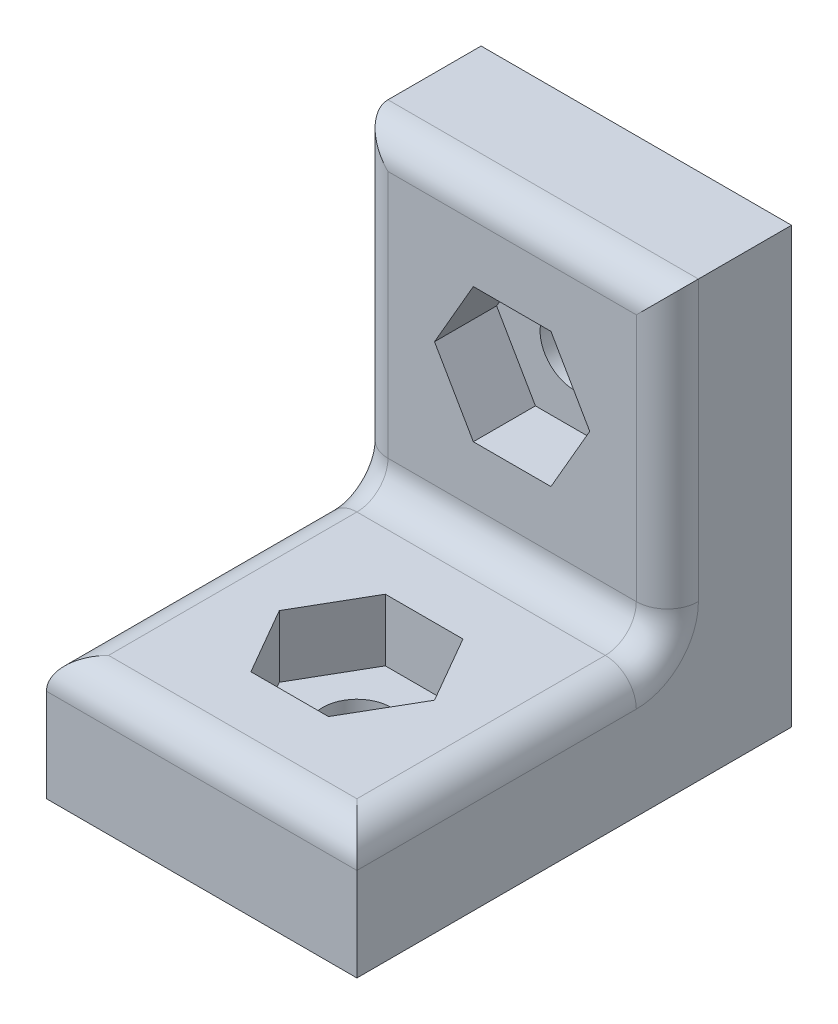
ISO-10303-21;
HEADER;
FILE_DESCRIPTION(('STEP AP214'),'2;1');
FILE_NAME('part.step','',(''),(''),'','','');
FILE_SCHEMA(('AUTOMOTIVE_DESIGN { 1 0 10303 214 1 1 1 1 }'));
ENDSEC;
DATA;
#1=APPLICATION_CONTEXT('core data for automotive mechanical design processes');
#2=APPLICATION_PROTOCOL_DEFINITION('international standard','automotive_design',2000,#1);
#3=PRODUCT_CONTEXT('',#1,'mechanical');
#4=PRODUCT('Part','Part','',(#3));
#5=PRODUCT_RELATED_PRODUCT_CATEGORY('part','',(#4));
#6=PRODUCT_DEFINITION_FORMATION('','',#4);
#7=PRODUCT_DEFINITION_CONTEXT('part definition',#1,'design');
#8=PRODUCT_DEFINITION('design','',#6,#7);
#9=PRODUCT_DEFINITION_SHAPE('','',#8);
#10=(LENGTH_UNIT() NAMED_UNIT(*) SI_UNIT(.MILLI.,.METRE.));
#11=(NAMED_UNIT(*) PLANE_ANGLE_UNIT() SI_UNIT($,.RADIAN.));
#12=(NAMED_UNIT(*) SI_UNIT($,.STERADIAN.) SOLID_ANGLE_UNIT());
#13=UNCERTAINTY_MEASURE_WITH_UNIT(LENGTH_MEASURE(1.E-05),#10,'distance_accuracy_value','');
#14=(GEOMETRIC_REPRESENTATION_CONTEXT(3) GLOBAL_UNCERTAINTY_ASSIGNED_CONTEXT((#13)) GLOBAL_UNIT_ASSIGNED_CONTEXT((#10,
#11,#12)) REPRESENTATION_CONTEXT('',''));
#15=CARTESIAN_POINT('',(0.,0.,0.));
#16=DIRECTION('',(0.,0.,1.));
#17=DIRECTION('',(1.,0.,0.));
#18=AXIS2_PLACEMENT_3D('',#15,#16,#17);
#19=CARTESIAN_POINT('',(0.,0.,9.));
#20=DIRECTION('',(0.,1.,0.));
#21=DIRECTION('',(0.,0.,1.));
#22=AXIS2_PLACEMENT_3D('',#19,#20,#21);
#23=CYLINDRICAL_SURFACE('',#22,1.1);
#24=CARTESIAN_POINT('',(0.,0.,9.));
#25=DIRECTION('',(0.,1.,0.));
#26=DIRECTION('',(0.,0.,1.));
#27=AXIS2_PLACEMENT_3D('',#24,#25,#26);
#28=CIRCLE('',#27,1.1);
#29=CARTESIAN_POINT('',(0.,0.,10.1));
#30=VERTEX_POINT('',#29);
#31=EDGE_CURVE('E299',#30,#30,#28,.T.);
#32=ORIENTED_EDGE('',*,*,#31,.F.);
#33=EDGE_LOOP('',(#32));
#34=FACE_BOUND('',#33,.T.);
#35=CARTESIAN_POINT('',(0.,2.,9.));
#36=DIRECTION('',(0.,1.,0.));
#37=DIRECTION('',(0.,0.,1.));
#38=AXIS2_PLACEMENT_3D('',#35,#36,#37);
#39=CIRCLE('',#38,1.1);
#40=CARTESIAN_POINT('',(0.,2.,10.1));
#41=VERTEX_POINT('',#40);
#42=EDGE_CURVE('E44',#41,#41,#39,.F.);
#43=ORIENTED_EDGE('',*,*,#42,.F.);
#44=EDGE_LOOP('',(#43));
#45=FACE_BOUND('',#44,.T.);
#46=ADVANCED_FACE('F40',(#34,#45),#23,.F.);
#47=CARTESIAN_POINT('',(0.,9.,0.));
#48=DIRECTION('',(0.,0.,1.));
#49=DIRECTION('',(1.,0.,0.));
#50=AXIS2_PLACEMENT_3D('',#47,#48,#49);
#51=CYLINDRICAL_SURFACE('',#50,1.1);
#52=CARTESIAN_POINT('',(0.,9.,0.));
#53=DIRECTION('',(0.,0.,1.));
#54=DIRECTION('',(1.,0.,0.));
#55=AXIS2_PLACEMENT_3D('',#52,#53,#54);
#56=CIRCLE('',#55,1.1);
#57=CARTESIAN_POINT('',(1.1,9.,0.));
#58=VERTEX_POINT('',#57);
#59=EDGE_CURVE('E303',#58,#58,#56,.T.);
#60=ORIENTED_EDGE('',*,*,#59,.F.);
#61=EDGE_LOOP('',(#60));
#62=FACE_BOUND('',#61,.T.);
#63=CARTESIAN_POINT('',(0.,9.,2.));
#64=DIRECTION('',(0.,0.,1.));
#65=DIRECTION('',(1.,0.,0.));
#66=AXIS2_PLACEMENT_3D('',#63,#64,#65);
#67=CIRCLE('',#66,1.1);
#68=CARTESIAN_POINT('',(1.1,9.,2.));
#69=VERTEX_POINT('',#68);
#70=EDGE_CURVE('E289',#69,#69,#67,.F.);
#71=ORIENTED_EDGE('',*,*,#70,.F.);
#72=EDGE_LOOP('',(#71));
#73=FACE_BOUND('',#72,.T.);
#74=ADVANCED_FACE('F399',(#62,#73),#51,.F.);
#75=CARTESIAN_POINT('',(-5.,14.,4.));
#76=DIRECTION('',(1.,0.,0.));
#77=DIRECTION('',(0.,1.,0.));
#78=AXIS2_PLACEMENT_3D('',#75,#76,#77);
#79=PLANE('',#78);
#80=CARTESIAN_POINT('',(-5.,5.,5.));
#81=DIRECTION('',(1.,0.,0.));
#82=DIRECTION('',(0.,1.,0.));
#83=AXIS2_PLACEMENT_3D('',#80,#81,#82);
#84=CIRCLE('',#83,2.);
#85=CARTESIAN_POINT('',(-5.,5.,3.));
#86=VERTEX_POINT('',#85);
#87=CARTESIAN_POINT('',(-5.,3.,5.));
#88=VERTEX_POINT('',#87);
#89=EDGE_CURVE('E353',#86,#88,#84,.F.);
#90=ORIENTED_EDGE('',*,*,#89,.F.);
#91=DIRECTION('',(0.,-1.,0.));
#92=VECTOR('',#91,1.);
#93=CARTESIAN_POINT('',(-5.,14.,3.));
#94=LINE('',#93,#92);
#95=CARTESIAN_POINT('',(-5.,14.,3.));
#96=VERTEX_POINT('',#95);
#97=EDGE_CURVE('E358',#86,#96,#94,.F.);
#98=ORIENTED_EDGE('',*,*,#97,.T.);
#99=DIRECTION('',(0.,0.,-1.));
#100=VECTOR('',#99,1.);
#101=CARTESIAN_POINT('',(-5.,14.,4.));
#102=LINE('',#101,#100);
#103=CARTESIAN_POINT('',(-5.,14.,0.));
#104=VERTEX_POINT('',#103);
#105=EDGE_CURVE('E326',#96,#104,#102,.T.);
#106=ORIENTED_EDGE('',*,*,#105,.T.);
#107=DIRECTION('',(0.,-1.,0.));
#108=VECTOR('',#107,1.);
#109=CARTESIAN_POINT('',(-5.,14.,0.));
#110=LINE('',#109,#108);
#111=CARTESIAN_POINT('',(-5.,0.,0.));
#112=VERTEX_POINT('',#111);
#113=EDGE_CURVE('E315',#104,#112,#110,.T.);
#114=ORIENTED_EDGE('',*,*,#113,.T.);
#115=DIRECTION('',(0.,0.,-1.));
#116=VECTOR('',#115,1.);
#117=CARTESIAN_POINT('',(-5.,0.,4.));
#118=LINE('',#117,#116);
#119=CARTESIAN_POINT('',(-5.,0.,14.));
#120=VERTEX_POINT('',#119);
#121=EDGE_CURVE('E333',#120,#112,#118,.T.);
#122=ORIENTED_EDGE('',*,*,#121,.F.);
#123=DIRECTION('',(0.,-1.,0.));
#124=VECTOR('',#123,1.);
#125=CARTESIAN_POINT('',(-5.,0.,14.));
#126=LINE('',#125,#124);
#127=CARTESIAN_POINT('',(-5.,3.,14.));
#128=VERTEX_POINT('',#127);
#129=EDGE_CURVE('E306',#128,#120,#126,.T.);
#130=ORIENTED_EDGE('',*,*,#129,.F.);
#131=DIRECTION('',(0.,0.,-1.));
#132=VECTOR('',#131,1.);
#133=CARTESIAN_POINT('',(-5.,3.,4.));
#134=LINE('',#133,#132);
#135=EDGE_CURVE('E356',#128,#88,#134,.T.);
#136=ORIENTED_EDGE('',*,*,#135,.T.);
#137=EDGE_LOOP('',(#90,#98,#106,#114,#122,#130,#136));
#138=FACE_BOUND('',#137,.T.);
#139=ADVANCED_FACE('F401',(#138),#79,.F.);
#140=CARTESIAN_POINT('',(-5.,0.,4.));
#141=DIRECTION('',(0.,1.,0.));
#142=DIRECTION('',(0.,0.,1.));
#143=AXIS2_PLACEMENT_3D('',#140,#141,#142);
#144=PLANE('',#143);
#145=ORIENTED_EDGE('',*,*,#31,.T.);
#146=EDGE_LOOP('',(#145));
#147=FACE_BOUND('',#146,.T.);
#148=DIRECTION('',(1.,0.,0.));
#149=VECTOR('',#148,1.);
#150=CARTESIAN_POINT('',(-5.,0.,0.));
#151=LINE('',#150,#149);
#152=CARTESIAN_POINT('',(5.,0.,0.));
#153=VERTEX_POINT('',#152);
#154=EDGE_CURVE('E318',#112,#153,#151,.T.);
#155=ORIENTED_EDGE('',*,*,#154,.T.);
#156=DIRECTION('',(0.,0.,-1.));
#157=VECTOR('',#156,1.);
#158=CARTESIAN_POINT('',(5.,0.,4.));
#159=LINE('',#158,#157);
#160=CARTESIAN_POINT('',(5.,0.,14.));
#161=VERTEX_POINT('',#160);
#162=EDGE_CURVE('E330',#161,#153,#159,.T.);
#163=ORIENTED_EDGE('',*,*,#162,.F.);
#164=DIRECTION('',(1.,0.,0.));
#165=VECTOR('',#164,1.);
#166=CARTESIAN_POINT('',(-5.,0.,14.));
#167=LINE('',#166,#165);
#168=EDGE_CURVE('E309',#120,#161,#167,.T.);
#169=ORIENTED_EDGE('',*,*,#168,.F.);
#170=ORIENTED_EDGE('',*,*,#121,.T.);
#171=EDGE_LOOP('',(#155,#163,#169,#170));
#172=FACE_BOUND('',#171,.T.);
#173=ADVANCED_FACE('F408',(#147,#172),#144,.F.);
#174=CARTESIAN_POINT('',(5.,14.,4.));
#175=DIRECTION('',(-1.,0.,0.));
#176=DIRECTION('',(0.,-1.,0.));
#177=AXIS2_PLACEMENT_3D('',#174,#175,#176);
#178=PLANE('',#177);
#179=DIRECTION('',(0.,0.,-1.));
#180=VECTOR('',#179,1.);
#181=CARTESIAN_POINT('',(5.,14.,4.));
#182=LINE('',#181,#180);
#183=CARTESIAN_POINT('',(5.,14.,3.));
#184=VERTEX_POINT('',#183);
#185=CARTESIAN_POINT('',(5.,14.,0.));
#186=VERTEX_POINT('',#185);
#187=EDGE_CURVE('E328',#184,#186,#182,.T.);
#188=ORIENTED_EDGE('',*,*,#187,.F.);
#189=DIRECTION('',(0.,1.,0.));
#190=VECTOR('',#189,1.);
#191=CARTESIAN_POINT('',(5.,4.,3.));
#192=LINE('',#191,#190);
#193=CARTESIAN_POINT('',(5.,5.,3.));
#194=VERTEX_POINT('',#193);
#195=EDGE_CURVE('E350',#184,#194,#192,.F.);
#196=ORIENTED_EDGE('',*,*,#195,.T.);
#197=CARTESIAN_POINT('',(5.,5.,5.));
#198=DIRECTION('',(-1.,0.,0.));
#199=DIRECTION('',(0.,-1.,0.));
#200=AXIS2_PLACEMENT_3D('',#197,#198,#199);
#201=CIRCLE('',#200,2.);
#202=CARTESIAN_POINT('',(5.,3.,5.));
#203=VERTEX_POINT('',#202);
#204=EDGE_CURVE('E347',#203,#194,#201,.F.);
#205=ORIENTED_EDGE('',*,*,#204,.F.);
#206=DIRECTION('',(0.,0.,-1.));
#207=VECTOR('',#206,1.);
#208=CARTESIAN_POINT('',(5.,3.,4.));
#209=LINE('',#208,#207);
#210=CARTESIAN_POINT('',(5.,3.,14.));
#211=VERTEX_POINT('',#210);
#212=EDGE_CURVE('E345',#203,#211,#209,.F.);
#213=ORIENTED_EDGE('',*,*,#212,.T.);
#214=DIRECTION('',(0.,1.,0.));
#215=VECTOR('',#214,1.);
#216=CARTESIAN_POINT('',(5.,0.,14.));
#217=LINE('',#216,#215);
#218=EDGE_CURVE('E312',#161,#211,#217,.T.);
#219=ORIENTED_EDGE('',*,*,#218,.F.);
#220=ORIENTED_EDGE('',*,*,#162,.T.);
#221=DIRECTION('',(0.,1.,0.));
#222=VECTOR('',#221,1.);
#223=CARTESIAN_POINT('',(5.,14.,0.));
#224=LINE('',#223,#222);
#225=EDGE_CURVE('E320',#153,#186,#224,.T.);
#226=ORIENTED_EDGE('',*,*,#225,.T.);
#227=EDGE_LOOP('',(#188,#196,#205,#213,#219,#220,#226));
#228=FACE_BOUND('',#227,.T.);
#229=ADVANCED_FACE('F435',(#228),#178,.F.);
#230=CARTESIAN_POINT('',(-5.,14.,4.));
#231=DIRECTION('',(0.,-1.,0.));
#232=DIRECTION('',(0.,0.,-1.));
#233=AXIS2_PLACEMENT_3D('',#230,#231,#232);
#234=PLANE('',#233);
#235=ORIENTED_EDGE('',*,*,#105,.F.);
#236=DIRECTION('',(-1.,0.,0.));
#237=VECTOR('',#236,1.);
#238=CARTESIAN_POINT('',(5.,14.,3.));
#239=LINE('',#238,#237);
#240=EDGE_CURVE('E360',#96,#184,#239,.F.);
#241=ORIENTED_EDGE('',*,*,#240,.T.);
#242=ORIENTED_EDGE('',*,*,#187,.T.);
#243=DIRECTION('',(-1.,0.,0.));
#244=VECTOR('',#243,1.);
#245=CARTESIAN_POINT('',(-5.,14.,0.));
#246=LINE('',#245,#244);
#247=EDGE_CURVE('E323',#186,#104,#246,.T.);
#248=ORIENTED_EDGE('',*,*,#247,.T.);
#249=EDGE_LOOP('',(#235,#241,#242,#248));
#250=FACE_BOUND('',#249,.T.);
#251=ADVANCED_FACE('F428',(#250),#234,.F.);
#252=CARTESIAN_POINT('',(0.,0.,4.));
#253=DIRECTION('',(0.,0.,1.));
#254=DIRECTION('',(1.,0.,0.));
#255=AXIS2_PLACEMENT_3D('',#252,#253,#254);
#256=PLANE('',#255);
#257=DIRECTION('',(1.,0.,0.));
#258=VECTOR('',#257,1.);
#259=CARTESIAN_POINT('',(-1.25,6.83493649053891,4.));
#260=LINE('',#259,#258);
#261=CARTESIAN_POINT('',(-1.25,6.83493649053891,4.));
#262=VERTEX_POINT('',#261);
#263=CARTESIAN_POINT('',(1.25,6.83493649053891,4.));
#264=VERTEX_POINT('',#263);
#265=EDGE_CURVE('E65',#262,#264,#260,.T.);
#266=ORIENTED_EDGE('',*,*,#265,.F.);
#267=DIRECTION('',(0.5,-0.866025403784439,0.));
#268=VECTOR('',#267,1.);
#269=CARTESIAN_POINT('',(-2.5,9.,4.));
#270=LINE('',#269,#268);
#271=CARTESIAN_POINT('',(-2.5,9.,4.));
#272=VERTEX_POINT('',#271);
#273=EDGE_CURVE('E256',#272,#262,#270,.T.);
#274=ORIENTED_EDGE('',*,*,#273,.F.);
#275=DIRECTION('',(-0.5,-0.866025403784438,0.));
#276=VECTOR('',#275,1.);
#277=CARTESIAN_POINT('',(-1.25,11.1650635094611,4.));
#278=LINE('',#277,#276);
#279=CARTESIAN_POINT('',(-1.25,11.1650635094611,4.));
#280=VERTEX_POINT('',#279);
#281=EDGE_CURVE('E282',#280,#272,#278,.T.);
#282=ORIENTED_EDGE('',*,*,#281,.F.);
#283=DIRECTION('',(-1.,0.,0.));
#284=VECTOR('',#283,1.);
#285=CARTESIAN_POINT('',(1.25,11.1650635094611,4.));
#286=LINE('',#285,#284);
#287=CARTESIAN_POINT('',(1.25,11.1650635094611,4.));
#288=VERTEX_POINT('',#287);
#289=EDGE_CURVE('E279',#288,#280,#286,.T.);
#290=ORIENTED_EDGE('',*,*,#289,.F.);
#291=DIRECTION('',(-0.5,0.866025403784439,0.));
#292=VECTOR('',#291,1.);
#293=CARTESIAN_POINT('',(2.5,9.,4.));
#294=LINE('',#293,#292);
#295=CARTESIAN_POINT('',(2.5,9.,4.));
#296=VERTEX_POINT('',#295);
#297=EDGE_CURVE('E276',#296,#288,#294,.T.);
#298=ORIENTED_EDGE('',*,*,#297,.F.);
#299=DIRECTION('',(0.5,0.866025403784439,0.));
#300=VECTOR('',#299,1.);
#301=CARTESIAN_POINT('',(1.25,6.83493649053891,4.));
#302=LINE('',#301,#300);
#303=EDGE_CURVE('E273',#264,#296,#302,.T.);
#304=ORIENTED_EDGE('',*,*,#303,.F.);
#305=EDGE_LOOP('',(#266,#274,#282,#290,#298,#304));
#306=FACE_BOUND('',#305,.T.);
#307=DIRECTION('',(0.,1.,0.));
#308=VECTOR('',#307,1.);
#309=CARTESIAN_POINT('',(4.,14.,4.));
#310=LINE('',#309,#308);
#311=CARTESIAN_POINT('',(4.,5.,4.));
#312=VERTEX_POINT('',#311);
#313=CARTESIAN_POINT('',(4.,13.,4.));
#314=VERTEX_POINT('',#313);
#315=EDGE_CURVE('E340',#312,#314,#310,.T.);
#316=ORIENTED_EDGE('',*,*,#315,.T.);
#317=DIRECTION('',(-1.,0.,0.));
#318=VECTOR('',#317,1.);
#319=CARTESIAN_POINT('',(-5.,13.,4.));
#320=LINE('',#319,#318);
#321=CARTESIAN_POINT('',(-4.,13.,4.));
#322=VERTEX_POINT('',#321);
#323=EDGE_CURVE('E343',#314,#322,#320,.T.);
#324=ORIENTED_EDGE('',*,*,#323,.T.);
#325=DIRECTION('',(0.,-1.,0.));
#326=VECTOR('',#325,1.);
#327=CARTESIAN_POINT('',(-4.,4.,4.));
#328=LINE('',#327,#326);
#329=CARTESIAN_POINT('',(-4.,5.,4.));
#330=VERTEX_POINT('',#329);
#331=EDGE_CURVE('E338',#322,#330,#328,.T.);
#332=ORIENTED_EDGE('',*,*,#331,.T.);
#333=DIRECTION('',(-1.,0.,0.));
#334=VECTOR('',#333,1.);
#335=CARTESIAN_POINT('',(0.,5.,4.));
#336=LINE('',#335,#334);
#337=EDGE_CURVE('E336',#330,#312,#336,.F.);
#338=ORIENTED_EDGE('',*,*,#337,.T.);
#339=EDGE_LOOP('',(#316,#324,#332,#338));
#340=FACE_BOUND('',#339,.T.);
#341=ADVANCED_FACE('F425',(#306,#340),#256,.T.);
#342=CARTESIAN_POINT('',(0.,0.,0.));
#343=DIRECTION('',(0.,0.,1.));
#344=DIRECTION('',(1.,0.,0.));
#345=AXIS2_PLACEMENT_3D('',#342,#343,#344);
#346=PLANE('',#345);
#347=ORIENTED_EDGE('',*,*,#59,.T.);
#348=EDGE_LOOP('',(#347));
#349=FACE_BOUND('',#348,.T.);
#350=ORIENTED_EDGE('',*,*,#113,.F.);
#351=ORIENTED_EDGE('',*,*,#247,.F.);
#352=ORIENTED_EDGE('',*,*,#225,.F.);
#353=ORIENTED_EDGE('',*,*,#154,.F.);
#354=EDGE_LOOP('',(#350,#351,#352,#353));
#355=FACE_BOUND('',#354,.T.);
#356=ADVANCED_FACE('F423',(#349,#355),#346,.F.);
#357=CARTESIAN_POINT('',(-5.,4.,14.));
#358=DIRECTION('',(0.,-1.,0.));
#359=DIRECTION('',(0.,0.,-1.));
#360=AXIS2_PLACEMENT_3D('',#357,#358,#359);
#361=PLANE('',#360);
#362=DIRECTION('',(-0.5,0.,-0.866025403784439));
#363=VECTOR('',#362,1.);
#364=CARTESIAN_POINT('',(2.5,4.,9.));
#365=LINE('',#364,#363);
#366=CARTESIAN_POINT('',(2.5,4.,9.));
#367=VERTEX_POINT('',#366);
#368=CARTESIAN_POINT('',(1.25,4.,6.8349364905389));
#369=VERTEX_POINT('',#368);
#370=EDGE_CURVE('E233',#367,#369,#365,.T.);
#371=ORIENTED_EDGE('',*,*,#370,.F.);
#372=DIRECTION('',(0.5,0.,-0.866025403784439));
#373=VECTOR('',#372,1.);
#374=CARTESIAN_POINT('',(1.25,4.,11.1650635094611));
#375=LINE('',#374,#373);
#376=CARTESIAN_POINT('',(1.25,4.,11.1650635094611));
#377=VERTEX_POINT('',#376);
#378=EDGE_CURVE('E57',#377,#367,#375,.T.);
#379=ORIENTED_EDGE('',*,*,#378,.F.);
#380=DIRECTION('',(1.,0.,0.));
#381=VECTOR('',#380,1.);
#382=CARTESIAN_POINT('',(-1.25,4.,11.1650635094611));
#383=LINE('',#382,#381);
#384=CARTESIAN_POINT('',(-1.25,4.,11.1650635094611));
#385=VERTEX_POINT('',#384);
#386=EDGE_CURVE('E219',#385,#377,#383,.T.);
#387=ORIENTED_EDGE('',*,*,#386,.F.);
#388=DIRECTION('',(0.5,0.,0.866025403784439));
#389=VECTOR('',#388,1.);
#390=CARTESIAN_POINT('',(-2.5,4.,9.));
#391=LINE('',#390,#389);
#392=CARTESIAN_POINT('',(-2.5,4.,9.));
#393=VERTEX_POINT('',#392);
#394=EDGE_CURVE('E222',#393,#385,#391,.T.);
#395=ORIENTED_EDGE('',*,*,#394,.F.);
#396=DIRECTION('',(-0.5,0.,0.866025403784439));
#397=VECTOR('',#396,1.);
#398=CARTESIAN_POINT('',(-1.25,4.,6.8349364905389));
#399=LINE('',#398,#397);
#400=CARTESIAN_POINT('',(-1.25,4.,6.8349364905389));
#401=VERTEX_POINT('',#400);
#402=EDGE_CURVE('E238',#401,#393,#399,.T.);
#403=ORIENTED_EDGE('',*,*,#402,.F.);
#404=DIRECTION('',(-1.,0.,0.));
#405=VECTOR('',#404,1.);
#406=CARTESIAN_POINT('',(1.25,4.,6.8349364905389));
#407=LINE('',#406,#405);
#408=EDGE_CURVE('E235',#369,#401,#407,.T.);
#409=ORIENTED_EDGE('',*,*,#408,.F.);
#410=EDGE_LOOP('',(#371,#379,#387,#395,#403,#409));
#411=FACE_BOUND('',#410,.T.);
#412=DIRECTION('',(0.,0.,-1.));
#413=VECTOR('',#412,1.);
#414=CARTESIAN_POINT('',(-4.,4.,14.));
#415=LINE('',#414,#413);
#416=CARTESIAN_POINT('',(-4.,4.,5.));
#417=VERTEX_POINT('',#416);
#418=CARTESIAN_POINT('',(-4.,4.,13.));
#419=VERTEX_POINT('',#418);
#420=EDGE_CURVE('E366',#417,#419,#415,.F.);
#421=ORIENTED_EDGE('',*,*,#420,.T.);
#422=DIRECTION('',(-1.,0.,0.));
#423=VECTOR('',#422,1.);
#424=CARTESIAN_POINT('',(-5.,4.,13.));
#425=LINE('',#424,#423);
#426=CARTESIAN_POINT('',(4.,4.,13.));
#427=VERTEX_POINT('',#426);
#428=EDGE_CURVE('E12',#419,#427,#425,.F.);
#429=ORIENTED_EDGE('',*,*,#428,.T.);
#430=DIRECTION('',(0.,0.,-1.));
#431=VECTOR('',#430,1.);
#432=CARTESIAN_POINT('',(4.,4.,14.));
#433=LINE('',#432,#431);
#434=CARTESIAN_POINT('',(4.,4.,5.));
#435=VERTEX_POINT('',#434);
#436=EDGE_CURVE('E49',#427,#435,#433,.T.);
#437=ORIENTED_EDGE('',*,*,#436,.T.);
#438=DIRECTION('',(-1.,0.,0.));
#439=VECTOR('',#438,1.);
#440=CARTESIAN_POINT('',(-5.,4.,5.));
#441=LINE('',#440,#439);
#442=EDGE_CURVE('E364',#435,#417,#441,.T.);
#443=ORIENTED_EDGE('',*,*,#442,.T.);
#444=EDGE_LOOP('',(#421,#429,#437,#443));
#445=FACE_BOUND('',#444,.T.);
#446=ADVANCED_FACE('F419',(#411,#445),#361,.F.);
#447=CARTESIAN_POINT('',(0.,0.,14.));
#448=DIRECTION('',(0.,0.,-1.));
#449=DIRECTION('',(-1.,0.,0.));
#450=AXIS2_PLACEMENT_3D('',#447,#448,#449);
#451=PLANE('',#450);
#452=ORIENTED_EDGE('',*,*,#218,.T.);
#453=DIRECTION('',(-1.,0.,0.));
#454=VECTOR('',#453,1.);
#455=CARTESIAN_POINT('',(0.,3.,14.));
#456=LINE('',#455,#454);
#457=EDGE_CURVE('E362',#211,#128,#456,.T.);
#458=ORIENTED_EDGE('',*,*,#457,.T.);
#459=ORIENTED_EDGE('',*,*,#129,.T.);
#460=ORIENTED_EDGE('',*,*,#168,.T.);
#461=EDGE_LOOP('',(#452,#458,#459,#460));
#462=FACE_BOUND('',#461,.T.);
#463=ADVANCED_FACE('F416',(#462),#451,.F.);
#464=CARTESIAN_POINT('',(-4.,3.,4.));
#465=DIRECTION('',(0.,0.,-1.));
#466=DIRECTION('',(-1.,0.,0.));
#467=AXIS2_PLACEMENT_3D('',#464,#465,#466);
#468=CYLINDRICAL_SURFACE('',#467,1.);
#469=CARTESIAN_POINT('',(-4.,3.,5.));
#470=DIRECTION('',(0.,0.,-1.));
#471=DIRECTION('',(-1.,0.,0.));
#472=AXIS2_PLACEMENT_3D('',#469,#470,#471);
#473=CIRCLE('',#472,1.);
#474=EDGE_CURVE('E390',#88,#417,#473,.T.);
#475=ORIENTED_EDGE('',*,*,#474,.F.);
#476=ORIENTED_EDGE('',*,*,#135,.F.);
#477=CARTESIAN_POINT('',(-4.,3.,13.));
#478=DIRECTION('',(-0.707106781186547,0.,-0.707106781186547));
#479=DIRECTION('',(0.707106781186547,0.,-0.707106781186547));
#480=AXIS2_PLACEMENT_3D('',#477,#478,#479);
#481=ELLIPSE('',#480,1.41421356237309,1.);
#482=EDGE_CURVE('E307',#419,#128,#481,.F.);
#483=ORIENTED_EDGE('',*,*,#482,.F.);
#484=ORIENTED_EDGE('',*,*,#420,.F.);
#485=EDGE_LOOP('',(#475,#476,#483,#484));
#486=FACE_BOUND('',#485,.T.);
#487=ADVANCED_FACE('F42',(#486),#468,.T.);
#488=CARTESIAN_POINT('',(0.,3.,13.));
#489=DIRECTION('',(-1.,0.,0.));
#490=DIRECTION('',(0.,0.,1.));
#491=AXIS2_PLACEMENT_3D('',#488,#489,#490);
#492=CYLINDRICAL_SURFACE('',#491,1.);
#493=ORIENTED_EDGE('',*,*,#482,.T.);
#494=ORIENTED_EDGE('',*,*,#457,.F.);
#495=CARTESIAN_POINT('',(4.,3.,13.));
#496=DIRECTION('',(0.707106781186547,0.,-0.707106781186547));
#497=DIRECTION('',(-0.707106781186547,0.,-0.707106781186547));
#498=AXIS2_PLACEMENT_3D('',#495,#496,#497);
#499=ELLIPSE('',#498,1.41421356237309,1.);
#500=EDGE_CURVE('E387',#427,#211,#499,.T.);
#501=ORIENTED_EDGE('',*,*,#500,.F.);
#502=ORIENTED_EDGE('',*,*,#428,.F.);
#503=EDGE_LOOP('',(#493,#494,#501,#502));
#504=FACE_BOUND('',#503,.T.);
#505=ADVANCED_FACE('F469',(#504),#492,.T.);
#506=CARTESIAN_POINT('',(-4.,5.,5.));
#507=DIRECTION('',(1.,0.,0.));
#508=DIRECTION('',(0.,1.,0.));
#509=AXIS2_PLACEMENT_3D('',#506,#507,#508);
#510=TOROIDAL_SURFACE('',#509,2.,1.);
#511=ORIENTED_EDGE('',*,*,#89,.T.);
#512=ORIENTED_EDGE('',*,*,#474,.T.);
#513=CARTESIAN_POINT('',(-4.,5.,5.));
#514=DIRECTION('',(1.,0.,0.));
#515=DIRECTION('',(0.,1.,0.));
#516=AXIS2_PLACEMENT_3D('',#513,#514,#515);
#517=CIRCLE('',#516,1.);
#518=EDGE_CURVE('E384',#330,#417,#517,.F.);
#519=ORIENTED_EDGE('',*,*,#518,.F.);
#520=CARTESIAN_POINT('',(-4.,5.,3.));
#521=DIRECTION('',(0.,-1.,0.));
#522=DIRECTION('',(0.,0.,-1.));
#523=AXIS2_PLACEMENT_3D('',#520,#521,#522);
#524=CIRCLE('',#523,1.);
#525=EDGE_CURVE('E381',#86,#330,#524,.F.);
#526=ORIENTED_EDGE('',*,*,#525,.F.);
#527=EDGE_LOOP('',(#511,#512,#519,#526));
#528=FACE_BOUND('',#527,.T.);
#529=ADVANCED_FACE('F466',(#528),#510,.T.);
#530=CARTESIAN_POINT('',(4.,3.,14.));
#531=DIRECTION('',(0.,0.,-1.));
#532=DIRECTION('',(-1.,0.,0.));
#533=AXIS2_PLACEMENT_3D('',#530,#531,#532);
#534=CYLINDRICAL_SURFACE('',#533,1.);
#535=ORIENTED_EDGE('',*,*,#500,.T.);
#536=ORIENTED_EDGE('',*,*,#212,.F.);
#537=CARTESIAN_POINT('',(4.,3.,5.));
#538=DIRECTION('',(0.,0.,-1.));
#539=DIRECTION('',(-1.,0.,0.));
#540=AXIS2_PLACEMENT_3D('',#537,#538,#539);
#541=CIRCLE('',#540,1.);
#542=EDGE_CURVE('E378',#435,#203,#541,.T.);
#543=ORIENTED_EDGE('',*,*,#542,.F.);
#544=ORIENTED_EDGE('',*,*,#436,.F.);
#545=EDGE_LOOP('',(#535,#536,#543,#544));
#546=FACE_BOUND('',#545,.T.);
#547=ADVANCED_FACE('F462',(#546),#534,.T.);
#548=CARTESIAN_POINT('',(-5.,5.,5.));
#549=DIRECTION('',(-1.,0.,0.));
#550=DIRECTION('',(0.,0.,1.));
#551=AXIS2_PLACEMENT_3D('',#548,#549,#550);
#552=CYLINDRICAL_SURFACE('',#551,1.);
#553=ORIENTED_EDGE('',*,*,#518,.T.);
#554=ORIENTED_EDGE('',*,*,#442,.F.);
#555=CARTESIAN_POINT('',(4.,5.,5.));
#556=DIRECTION('',(-1.,0.,0.));
#557=DIRECTION('',(0.,-1.,0.));
#558=AXIS2_PLACEMENT_3D('',#555,#556,#557);
#559=CIRCLE('',#558,1.);
#560=EDGE_CURVE('E375',#312,#435,#559,.T.);
#561=ORIENTED_EDGE('',*,*,#560,.F.);
#562=ORIENTED_EDGE('',*,*,#337,.F.);
#563=EDGE_LOOP('',(#553,#554,#561,#562));
#564=FACE_BOUND('',#563,.T.);
#565=ADVANCED_FACE('F458',(#564),#552,.F.);
#566=CARTESIAN_POINT('',(-4.,0.,3.));
#567=DIRECTION('',(0.,1.,0.));
#568=DIRECTION('',(-1.,0.,0.));
#569=AXIS2_PLACEMENT_3D('',#566,#567,#568);
#570=CYLINDRICAL_SURFACE('',#569,1.);
#571=ORIENTED_EDGE('',*,*,#525,.T.);
#572=ORIENTED_EDGE('',*,*,#331,.F.);
#573=CARTESIAN_POINT('',(-4.,13.,3.));
#574=DIRECTION('',(0.707106781186547,0.707106781186548,0.));
#575=DIRECTION('',(0.707106781186548,-0.707106781186547,0.));
#576=AXIS2_PLACEMENT_3D('',#573,#574,#575);
#577=ELLIPSE('',#576,1.4142135623731,1.);
#578=EDGE_CURVE('E372',#96,#322,#577,.T.);
#579=ORIENTED_EDGE('',*,*,#578,.F.);
#580=ORIENTED_EDGE('',*,*,#97,.F.);
#581=EDGE_LOOP('',(#571,#572,#579,#580));
#582=FACE_BOUND('',#581,.T.);
#583=ADVANCED_FACE('F454',(#582),#570,.T.);
#584=CARTESIAN_POINT('',(4.,5.,5.));
#585=DIRECTION('',(-1.,0.,0.));
#586=DIRECTION('',(0.,-1.,0.));
#587=AXIS2_PLACEMENT_3D('',#584,#585,#586);
#588=TOROIDAL_SURFACE('',#587,2.,1.);
#589=ORIENTED_EDGE('',*,*,#542,.T.);
#590=ORIENTED_EDGE('',*,*,#204,.T.);
#591=CARTESIAN_POINT('',(4.,5.,3.));
#592=DIRECTION('',(0.,-1.,0.));
#593=DIRECTION('',(0.,0.,-1.));
#594=AXIS2_PLACEMENT_3D('',#591,#592,#593);
#595=CIRCLE('',#594,1.);
#596=EDGE_CURVE('E370',#312,#194,#595,.F.);
#597=ORIENTED_EDGE('',*,*,#596,.F.);
#598=ORIENTED_EDGE('',*,*,#560,.T.);
#599=EDGE_LOOP('',(#589,#590,#597,#598));
#600=FACE_BOUND('',#599,.T.);
#601=ADVANCED_FACE('F450',(#600),#588,.T.);
#602=CARTESIAN_POINT('',(0.,13.,3.));
#603=DIRECTION('',(1.,0.,0.));
#604=DIRECTION('',(0.,0.,-1.));
#605=AXIS2_PLACEMENT_3D('',#602,#603,#604);
#606=CYLINDRICAL_SURFACE('',#605,1.);
#607=ORIENTED_EDGE('',*,*,#578,.T.);
#608=ORIENTED_EDGE('',*,*,#323,.F.);
#609=CARTESIAN_POINT('',(4.,13.,3.));
#610=DIRECTION('',(0.707106781186548,-0.707106781186547,0.));
#611=DIRECTION('',(0.707106781186547,0.707106781186548,0.));
#612=AXIS2_PLACEMENT_3D('',#609,#610,#611);
#613=ELLIPSE('',#612,1.41421356237309,1.);
#614=EDGE_CURVE('E302',#184,#314,#613,.T.);
#615=ORIENTED_EDGE('',*,*,#614,.F.);
#616=ORIENTED_EDGE('',*,*,#240,.F.);
#617=EDGE_LOOP('',(#607,#608,#615,#616));
#618=FACE_BOUND('',#617,.T.);
#619=ADVANCED_FACE('F446',(#618),#606,.T.);
#620=CARTESIAN_POINT('',(4.,0.,3.));
#621=DIRECTION('',(0.,-1.,0.));
#622=DIRECTION('',(1.,0.,0.));
#623=AXIS2_PLACEMENT_3D('',#620,#621,#622);
#624=CYLINDRICAL_SURFACE('',#623,1.);
#625=ORIENTED_EDGE('',*,*,#596,.T.);
#626=ORIENTED_EDGE('',*,*,#195,.F.);
#627=ORIENTED_EDGE('',*,*,#614,.T.);
#628=ORIENTED_EDGE('',*,*,#315,.F.);
#629=EDGE_LOOP('',(#625,#626,#627,#628));
#630=FACE_BOUND('',#629,.T.);
#631=ADVANCED_FACE('F443',(#630),#624,.T.);
#632=CARTESIAN_POINT('',(0.,0.,2.));
#633=DIRECTION('',(0.,0.,1.));
#634=DIRECTION('',(1.,0.,0.));
#635=AXIS2_PLACEMENT_3D('',#632,#633,#634);
#636=PLANE('',#635);
#637=DIRECTION('',(1.,0.,0.));
#638=VECTOR('',#637,1.);
#639=CARTESIAN_POINT('',(-1.25,6.83493649053891,2.));
#640=LINE('',#639,#638);
#641=CARTESIAN_POINT('',(-1.25,6.83493649053891,2.));
#642=VERTEX_POINT('',#641);
#643=CARTESIAN_POINT('',(1.25,6.83493649053891,2.));
#644=VERTEX_POINT('',#643);
#645=EDGE_CURVE('E252',#642,#644,#640,.T.);
#646=ORIENTED_EDGE('',*,*,#645,.T.);
#647=DIRECTION('',(0.5,0.866025403784439,0.));
#648=VECTOR('',#647,1.);
#649=CARTESIAN_POINT('',(1.25,6.83493649053891,2.));
#650=LINE('',#649,#648);
#651=CARTESIAN_POINT('',(2.5,9.,2.));
#652=VERTEX_POINT('',#651);
#653=EDGE_CURVE('E255',#644,#652,#650,.T.);
#654=ORIENTED_EDGE('',*,*,#653,.T.);
#655=DIRECTION('',(-0.5,0.866025403784439,0.));
#656=VECTOR('',#655,1.);
#657=CARTESIAN_POINT('',(2.5,9.,2.));
#658=LINE('',#657,#656);
#659=CARTESIAN_POINT('',(1.25,11.1650635094611,2.));
#660=VERTEX_POINT('',#659);
#661=EDGE_CURVE('E259',#652,#660,#658,.T.);
#662=ORIENTED_EDGE('',*,*,#661,.T.);
#663=DIRECTION('',(-1.,0.,0.));
#664=VECTOR('',#663,1.);
#665=CARTESIAN_POINT('',(1.25,11.1650635094611,2.));
#666=LINE('',#665,#664);
#667=CARTESIAN_POINT('',(-1.25,11.1650635094611,2.));
#668=VERTEX_POINT('',#667);
#669=EDGE_CURVE('E262',#660,#668,#666,.T.);
#670=ORIENTED_EDGE('',*,*,#669,.T.);
#671=DIRECTION('',(-0.5,-0.866025403784438,0.));
#672=VECTOR('',#671,1.);
#673=CARTESIAN_POINT('',(-1.25,11.1650635094611,2.));
#674=LINE('',#673,#672);
#675=CARTESIAN_POINT('',(-2.5,9.,2.));
#676=VERTEX_POINT('',#675);
#677=EDGE_CURVE('E265',#668,#676,#674,.T.);
#678=ORIENTED_EDGE('',*,*,#677,.T.);
#679=DIRECTION('',(0.5,-0.866025403784439,0.));
#680=VECTOR('',#679,1.);
#681=CARTESIAN_POINT('',(-2.5,9.,2.));
#682=LINE('',#681,#680);
#683=EDGE_CURVE('E268',#676,#642,#682,.T.);
#684=ORIENTED_EDGE('',*,*,#683,.T.);
#685=EDGE_LOOP('',(#646,#654,#662,#670,#678,#684));
#686=FACE_BOUND('',#685,.T.);
#687=ORIENTED_EDGE('',*,*,#70,.T.);
#688=EDGE_LOOP('',(#687));
#689=FACE_BOUND('',#688,.T.);
#690=ADVANCED_FACE('F397',(#686,#689),#636,.T.);
#691=CARTESIAN_POINT('',(-1.25,6.83493649053891,2.));
#692=DIRECTION('',(0.,-1.,0.));
#693=DIRECTION('',(0.,0.,-1.));
#694=AXIS2_PLACEMENT_3D('',#691,#692,#693);
#695=PLANE('',#694);
#696=ORIENTED_EDGE('',*,*,#265,.T.);
#697=DIRECTION('',(0.,0.,1.));
#698=VECTOR('',#697,1.);
#699=CARTESIAN_POINT('',(1.25,6.83493649053891,2.));
#700=LINE('',#699,#698);
#701=EDGE_CURVE('E271',#644,#264,#700,.T.);
#702=ORIENTED_EDGE('',*,*,#701,.F.);
#703=ORIENTED_EDGE('',*,*,#645,.F.);
#704=DIRECTION('',(0.,0.,1.));
#705=VECTOR('',#704,1.);
#706=CARTESIAN_POINT('',(-1.25,6.83493649053891,2.));
#707=LINE('',#706,#705);
#708=EDGE_CURVE('E287',#642,#262,#707,.T.);
#709=ORIENTED_EDGE('',*,*,#708,.T.);
#710=EDGE_LOOP('',(#696,#702,#703,#709));
#711=FACE_BOUND('',#710,.T.);
#712=ADVANCED_FACE('F627',(#711),#695,.F.);
#713=CARTESIAN_POINT('',(-2.5,9.,2.));
#714=DIRECTION('',(-0.866025403784439,-0.5,0.));
#715=DIRECTION('',(0.5,-0.866025403784439,0.));
#716=AXIS2_PLACEMENT_3D('',#713,#714,#715);
#717=PLANE('',#716);
#718=ORIENTED_EDGE('',*,*,#273,.T.);
#719=ORIENTED_EDGE('',*,*,#708,.F.);
#720=ORIENTED_EDGE('',*,*,#683,.F.);
#721=DIRECTION('',(0.,0.,1.));
#722=VECTOR('',#721,1.);
#723=CARTESIAN_POINT('',(-2.5,9.,2.));
#724=LINE('',#723,#722);
#725=EDGE_CURVE('E290',#676,#272,#724,.T.);
#726=ORIENTED_EDGE('',*,*,#725,.T.);
#727=EDGE_LOOP('',(#718,#719,#720,#726));
#728=FACE_BOUND('',#727,.T.);
#729=ADVANCED_FACE('F636',(#728),#717,.F.);
#730=CARTESIAN_POINT('',(-1.25,11.1650635094611,2.));
#731=DIRECTION('',(-0.866025403784438,0.5,0.));
#732=DIRECTION('',(-0.5,-0.866025403784438,0.));
#733=AXIS2_PLACEMENT_3D('',#730,#731,#732);
#734=PLANE('',#733);
#735=ORIENTED_EDGE('',*,*,#281,.T.);
#736=ORIENTED_EDGE('',*,*,#725,.F.);
#737=ORIENTED_EDGE('',*,*,#677,.F.);
#738=DIRECTION('',(0.,0.,1.));
#739=VECTOR('',#738,1.);
#740=CARTESIAN_POINT('',(-1.25,11.1650635094611,2.));
#741=LINE('',#740,#739);
#742=EDGE_CURVE('E292',#668,#280,#741,.T.);
#743=ORIENTED_EDGE('',*,*,#742,.T.);
#744=EDGE_LOOP('',(#735,#736,#737,#743));
#745=FACE_BOUND('',#744,.T.);
#746=ADVANCED_FACE('F643',(#745),#734,.F.);
#747=CARTESIAN_POINT('',(1.25,11.1650635094611,2.));
#748=DIRECTION('',(0.,1.,0.));
#749=DIRECTION('',(0.,0.,1.));
#750=AXIS2_PLACEMENT_3D('',#747,#748,#749);
#751=PLANE('',#750);
#752=ORIENTED_EDGE('',*,*,#289,.T.);
#753=ORIENTED_EDGE('',*,*,#742,.F.);
#754=ORIENTED_EDGE('',*,*,#669,.F.);
#755=DIRECTION('',(0.,0.,1.));
#756=VECTOR('',#755,1.);
#757=CARTESIAN_POINT('',(1.25,11.1650635094611,2.));
#758=LINE('',#757,#756);
#759=EDGE_CURVE('E294',#660,#288,#758,.T.);
#760=ORIENTED_EDGE('',*,*,#759,.T.);
#761=EDGE_LOOP('',(#752,#753,#754,#760));
#762=FACE_BOUND('',#761,.T.);
#763=ADVANCED_FACE('F652',(#762),#751,.F.);
#764=CARTESIAN_POINT('',(2.5,9.,2.));
#765=DIRECTION('',(0.866025403784439,0.5,0.));
#766=DIRECTION('',(-0.5,0.866025403784439,0.));
#767=AXIS2_PLACEMENT_3D('',#764,#765,#766);
#768=PLANE('',#767);
#769=ORIENTED_EDGE('',*,*,#297,.T.);
#770=ORIENTED_EDGE('',*,*,#759,.F.);
#771=ORIENTED_EDGE('',*,*,#661,.F.);
#772=DIRECTION('',(0.,0.,1.));
#773=VECTOR('',#772,1.);
#774=CARTESIAN_POINT('',(2.5,9.,2.));
#775=LINE('',#774,#773);
#776=EDGE_CURVE('E296',#652,#296,#775,.T.);
#777=ORIENTED_EDGE('',*,*,#776,.T.);
#778=EDGE_LOOP('',(#769,#770,#771,#777));
#779=FACE_BOUND('',#778,.T.);
#780=ADVANCED_FACE('F661',(#779),#768,.F.);
#781=CARTESIAN_POINT('',(1.25,6.83493649053891,2.));
#782=DIRECTION('',(0.866025403784439,-0.5,0.));
#783=DIRECTION('',(0.5,0.866025403784439,0.));
#784=AXIS2_PLACEMENT_3D('',#781,#782,#783);
#785=PLANE('',#784);
#786=ORIENTED_EDGE('',*,*,#303,.T.);
#787=ORIENTED_EDGE('',*,*,#776,.F.);
#788=ORIENTED_EDGE('',*,*,#653,.F.);
#789=ORIENTED_EDGE('',*,*,#701,.T.);
#790=EDGE_LOOP('',(#786,#787,#788,#789));
#791=FACE_BOUND('',#790,.T.);
#792=ADVANCED_FACE('F670',(#791),#785,.F.);
#793=CARTESIAN_POINT('',(0.,2.,0.));
#794=DIRECTION('',(0.,1.,0.));
#795=DIRECTION('',(0.,0.,1.));
#796=AXIS2_PLACEMENT_3D('',#793,#794,#795);
#797=PLANE('',#796);
#798=DIRECTION('',(0.5,0.,-0.866025403784439));
#799=VECTOR('',#798,1.);
#800=CARTESIAN_POINT('',(1.25,2.,11.1650635094611));
#801=LINE('',#800,#799);
#802=CARTESIAN_POINT('',(1.25,2.,11.1650635094611));
#803=VERTEX_POINT('',#802);
#804=CARTESIAN_POINT('',(2.5,2.,9.));
#805=VERTEX_POINT('',#804);
#806=EDGE_CURVE('E199',#803,#805,#801,.T.);
#807=ORIENTED_EDGE('',*,*,#806,.T.);
#808=DIRECTION('',(-0.5,0.,-0.866025403784439));
#809=VECTOR('',#808,1.);
#810=CARTESIAN_POINT('',(2.5,2.,9.));
#811=LINE('',#810,#809);
#812=CARTESIAN_POINT('',(1.25,2.,6.8349364905389));
#813=VERTEX_POINT('',#812);
#814=EDGE_CURVE('E208',#805,#813,#811,.T.);
#815=ORIENTED_EDGE('',*,*,#814,.T.);
#816=DIRECTION('',(-1.,0.,0.));
#817=VECTOR('',#816,1.);
#818=CARTESIAN_POINT('',(1.25,2.,6.8349364905389));
#819=LINE('',#818,#817);
#820=CARTESIAN_POINT('',(-1.25,2.,6.8349364905389));
#821=VERTEX_POINT('',#820);
#822=EDGE_CURVE('E213',#813,#821,#819,.T.);
#823=ORIENTED_EDGE('',*,*,#822,.T.);
#824=DIRECTION('',(-0.5,0.,0.866025403784439));
#825=VECTOR('',#824,1.);
#826=CARTESIAN_POINT('',(-1.25,2.,6.8349364905389));
#827=LINE('',#826,#825);
#828=CARTESIAN_POINT('',(-2.5,2.,9.));
#829=VERTEX_POINT('',#828);
#830=EDGE_CURVE('E226',#821,#829,#827,.T.);
#831=ORIENTED_EDGE('',*,*,#830,.T.);
#832=DIRECTION('',(0.5,0.,0.866025403784439));
#833=VECTOR('',#832,1.);
#834=CARTESIAN_POINT('',(-2.5,2.,9.));
#835=LINE('',#834,#833);
#836=CARTESIAN_POINT('',(-1.25,2.,11.1650635094611));
#837=VERTEX_POINT('',#836);
#838=EDGE_CURVE('E229',#829,#837,#835,.T.);
#839=ORIENTED_EDGE('',*,*,#838,.T.);
#840=DIRECTION('',(1.,0.,0.));
#841=VECTOR('',#840,1.);
#842=CARTESIAN_POINT('',(-1.25,2.,11.1650635094611));
#843=LINE('',#842,#841);
#844=EDGE_CURVE('E205',#837,#803,#843,.T.);
#845=ORIENTED_EDGE('',*,*,#844,.T.);
#846=EDGE_LOOP('',(#807,#815,#823,#831,#839,#845));
#847=FACE_BOUND('',#846,.T.);
#848=ORIENTED_EDGE('',*,*,#42,.T.);
#849=EDGE_LOOP('',(#848));
#850=FACE_BOUND('',#849,.T.);
#851=ADVANCED_FACE('F215',(#847,#850),#797,.T.);
#852=CARTESIAN_POINT('',(1.25,2.,11.1650635094611));
#853=DIRECTION('',(0.866025403784439,0.,0.5));
#854=DIRECTION('',(0.5,0.,-0.866025403784439));
#855=AXIS2_PLACEMENT_3D('',#852,#853,#854);
#856=PLANE('',#855);
#857=ORIENTED_EDGE('',*,*,#378,.T.);
#858=DIRECTION('',(0.,1.,0.));
#859=VECTOR('',#858,1.);
#860=CARTESIAN_POINT('',(2.5,2.,9.));
#861=LINE('',#860,#859);
#862=EDGE_CURVE('E195',#805,#367,#861,.T.);
#863=ORIENTED_EDGE('',*,*,#862,.F.);
#864=ORIENTED_EDGE('',*,*,#806,.F.);
#865=DIRECTION('',(0.,1.,0.));
#866=VECTOR('',#865,1.);
#867=CARTESIAN_POINT('',(1.25,2.,11.1650635094611));
#868=LINE('',#867,#866);
#869=EDGE_CURVE('E243',#803,#377,#868,.T.);
#870=ORIENTED_EDGE('',*,*,#869,.T.);
#871=EDGE_LOOP('',(#857,#863,#864,#870));
#872=FACE_BOUND('',#871,.T.);
#873=ADVANCED_FACE('F197',(#872),#856,.F.);
#874=CARTESIAN_POINT('',(-1.25,2.,11.1650635094611));
#875=DIRECTION('',(0.,0.,1.));
#876=DIRECTION('',(1.,0.,0.));
#877=AXIS2_PLACEMENT_3D('',#874,#875,#876);
#878=PLANE('',#877);
#879=ORIENTED_EDGE('',*,*,#386,.T.);
#880=ORIENTED_EDGE('',*,*,#869,.F.);
#881=ORIENTED_EDGE('',*,*,#844,.F.);
#882=DIRECTION('',(0.,1.,0.));
#883=VECTOR('',#882,1.);
#884=CARTESIAN_POINT('',(-1.25,2.,11.1650635094611));
#885=LINE('',#884,#883);
#886=EDGE_CURVE('E245',#837,#385,#885,.T.);
#887=ORIENTED_EDGE('',*,*,#886,.T.);
#888=EDGE_LOOP('',(#879,#880,#881,#887));
#889=FACE_BOUND('',#888,.T.);
#890=ADVANCED_FACE('F697',(#889),#878,.F.);
#891=CARTESIAN_POINT('',(-2.5,2.,9.));
#892=DIRECTION('',(-0.866025403784439,0.,0.5));
#893=DIRECTION('',(0.5,0.,0.866025403784439));
#894=AXIS2_PLACEMENT_3D('',#891,#892,#893);
#895=PLANE('',#894);
#896=ORIENTED_EDGE('',*,*,#394,.T.);
#897=ORIENTED_EDGE('',*,*,#886,.F.);
#898=ORIENTED_EDGE('',*,*,#838,.F.);
#899=DIRECTION('',(0.,1.,0.));
#900=VECTOR('',#899,1.);
#901=CARTESIAN_POINT('',(-2.5,2.,9.));
#902=LINE('',#901,#900);
#903=EDGE_CURVE('E247',#829,#393,#902,.T.);
#904=ORIENTED_EDGE('',*,*,#903,.T.);
#905=EDGE_LOOP('',(#896,#897,#898,#904));
#906=FACE_BOUND('',#905,.T.);
#907=ADVANCED_FACE('F705',(#906),#895,.F.);
#908=CARTESIAN_POINT('',(-1.25,2.,6.8349364905389));
#909=DIRECTION('',(-0.866025403784439,0.,-0.5));
#910=DIRECTION('',(-0.5,0.,0.866025403784439));
#911=AXIS2_PLACEMENT_3D('',#908,#909,#910);
#912=PLANE('',#911);
#913=ORIENTED_EDGE('',*,*,#402,.T.);
#914=ORIENTED_EDGE('',*,*,#903,.F.);
#915=ORIENTED_EDGE('',*,*,#830,.F.);
#916=DIRECTION('',(0.,1.,0.));
#917=VECTOR('',#916,1.);
#918=CARTESIAN_POINT('',(-1.25,2.,6.8349364905389));
#919=LINE('',#918,#917);
#920=EDGE_CURVE('E249',#821,#401,#919,.T.);
#921=ORIENTED_EDGE('',*,*,#920,.T.);
#922=EDGE_LOOP('',(#913,#914,#915,#921));
#923=FACE_BOUND('',#922,.T.);
#924=ADVANCED_FACE('F714',(#923),#912,.F.);
#925=CARTESIAN_POINT('',(1.25,2.,6.8349364905389));
#926=DIRECTION('',(0.,0.,-1.));
#927=DIRECTION('',(-1.,0.,0.));
#928=AXIS2_PLACEMENT_3D('',#925,#926,#927);
#929=PLANE('',#928);
#930=ORIENTED_EDGE('',*,*,#408,.T.);
#931=ORIENTED_EDGE('',*,*,#920,.F.);
#932=ORIENTED_EDGE('',*,*,#822,.F.);
#933=DIRECTION('',(0.,1.,0.));
#934=VECTOR('',#933,1.);
#935=CARTESIAN_POINT('',(1.25,2.,6.8349364905389));
#936=LINE('',#935,#934);
#937=EDGE_CURVE('E204',#813,#369,#936,.T.);
#938=ORIENTED_EDGE('',*,*,#937,.T.);
#939=EDGE_LOOP('',(#930,#931,#932,#938));
#940=FACE_BOUND('',#939,.T.);
#941=ADVANCED_FACE('F723',(#940),#929,.F.);
#942=CARTESIAN_POINT('',(2.5,2.,9.));
#943=DIRECTION('',(0.866025403784439,0.,-0.5));
#944=DIRECTION('',(-0.5,0.,-0.866025403784439));
#945=AXIS2_PLACEMENT_3D('',#942,#943,#944);
#946=PLANE('',#945);
#947=ORIENTED_EDGE('',*,*,#370,.T.);
#948=ORIENTED_EDGE('',*,*,#937,.F.);
#949=ORIENTED_EDGE('',*,*,#814,.F.);
#950=ORIENTED_EDGE('',*,*,#862,.T.);
#951=EDGE_LOOP('',(#947,#948,#949,#950));
#952=FACE_BOUND('',#951,.T.);
#953=ADVANCED_FACE('F209',(#952),#946,.F.);
#954=CLOSED_SHELL('',(#46,#74,#139,#173,#229,#251,#341,#356,#446,#463,#487,#505,#529,#547,#565,
#583,#601,#619,#631,#690,#712,#729,#746,#763,#780,#792,#851,#873,#890,#907,#924,#941,#953));
#955=MANIFOLD_SOLID_BREP('B2',#954);
#956=ADVANCED_BREP_SHAPE_REPRESENTATION('',(#18,#955),#14);
#957=SHAPE_DEFINITION_REPRESENTATION(#9,#956);
ENDSEC;
END-ISO-10303-21;
